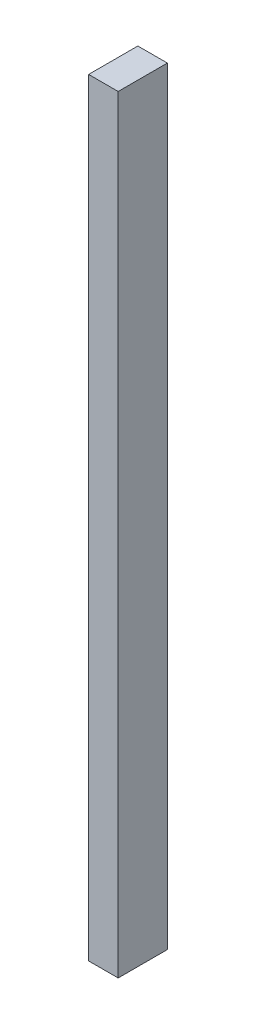
ISO-10303-21;
HEADER;
FILE_DESCRIPTION(('STEP AP214'),'2;1');
FILE_NAME('part.step','',(''),(''),'','','');
FILE_SCHEMA(('AUTOMOTIVE_DESIGN { 1 0 10303 214 1 1 1 1 }'));
ENDSEC;
DATA;
#1=APPLICATION_CONTEXT('core data for automotive mechanical design processes');
#2=APPLICATION_PROTOCOL_DEFINITION('international standard','automotive_design',2000,#1);
#3=PRODUCT_CONTEXT('',#1,'mechanical');
#4=PRODUCT('Part','Part','',(#3));
#5=PRODUCT_RELATED_PRODUCT_CATEGORY('part','',(#4));
#6=PRODUCT_DEFINITION_FORMATION('','',#4);
#7=PRODUCT_DEFINITION_CONTEXT('part definition',#1,'design');
#8=PRODUCT_DEFINITION('design','',#6,#7);
#9=PRODUCT_DEFINITION_SHAPE('','',#8);
#10=(LENGTH_UNIT() NAMED_UNIT(*) SI_UNIT(.MILLI.,.METRE.));
#11=(NAMED_UNIT(*) PLANE_ANGLE_UNIT() SI_UNIT($,.RADIAN.));
#12=(NAMED_UNIT(*) SI_UNIT($,.STERADIAN.) SOLID_ANGLE_UNIT());
#13=UNCERTAINTY_MEASURE_WITH_UNIT(LENGTH_MEASURE(1.E-05),#10,'distance_accuracy_value','');
#14=(GEOMETRIC_REPRESENTATION_CONTEXT(3) GLOBAL_UNCERTAINTY_ASSIGNED_CONTEXT((#13)) GLOBAL_UNIT_ASSIGNED_CONTEXT((#10,
#11,#12)) REPRESENTATION_CONTEXT('',''));
#15=CARTESIAN_POINT('',(0.,0.,0.));
#16=DIRECTION('',(0.,0.,1.));
#17=DIRECTION('',(1.,0.,0.));
#18=AXIS2_PLACEMENT_3D('',#15,#16,#17);
#19=CARTESIAN_POINT('',(19.05,990.6,31.75));
#20=DIRECTION('',(-1.,0.,0.));
#21=DIRECTION('',(0.,0.,1.));
#22=AXIS2_PLACEMENT_3D('',#19,#20,#21);
#23=PLANE('',#22);
#24=DIRECTION('',(0.,0.,-1.));
#25=VECTOR('',#24,1.);
#26=CARTESIAN_POINT('',(19.05,0.,31.75));
#27=LINE('',#26,#25);
#28=CARTESIAN_POINT('',(19.05,0.,31.75));
#29=VERTEX_POINT('',#28);
#30=CARTESIAN_POINT('',(19.05,0.,-31.75));
#31=VERTEX_POINT('',#30);
#32=EDGE_CURVE('E96',#29,#31,#27,.T.);
#33=ORIENTED_EDGE('',*,*,#32,.T.);
#34=DIRECTION('',(0.,-1.,0.));
#35=VECTOR('',#34,1.);
#36=CARTESIAN_POINT('',(19.05,990.6,-31.75));
#37=LINE('',#36,#35);
#38=CARTESIAN_POINT('',(19.05,990.6,-31.75));
#39=VERTEX_POINT('',#38);
#40=EDGE_CURVE('E11',#39,#31,#37,.T.);
#41=ORIENTED_EDGE('',*,*,#40,.F.);
#42=DIRECTION('',(0.,0.,-1.));
#43=VECTOR('',#42,1.);
#44=CARTESIAN_POINT('',(19.05,990.6,31.75));
#45=LINE('',#44,#43);
#46=CARTESIAN_POINT('',(19.05,990.6,31.75));
#47=VERTEX_POINT('',#46);
#48=EDGE_CURVE('E84',#47,#39,#45,.T.);
#49=ORIENTED_EDGE('',*,*,#48,.F.);
#50=DIRECTION('',(0.,-1.,0.));
#51=VECTOR('',#50,1.);
#52=CARTESIAN_POINT('',(19.05,990.6,31.75));
#53=LINE('',#52,#51);
#54=EDGE_CURVE('E92',#47,#29,#53,.T.);
#55=ORIENTED_EDGE('',*,*,#54,.T.);
#56=EDGE_LOOP('',(#33,#41,#49,#55));
#57=FACE_BOUND('',#56,.T.);
#58=ADVANCED_FACE('F33',(#57),#23,.F.);
#59=CARTESIAN_POINT('',(-19.05,990.6,-31.75));
#60=DIRECTION('',(0.,0.,1.));
#61=DIRECTION('',(1.,0.,0.));
#62=AXIS2_PLACEMENT_3D('',#59,#60,#61);
#63=PLANE('',#62);
#64=DIRECTION('',(-1.,0.,0.));
#65=VECTOR('',#64,1.);
#66=CARTESIAN_POINT('',(-19.05,0.,-31.75));
#67=LINE('',#66,#65);
#68=CARTESIAN_POINT('',(-19.05,0.,-31.75));
#69=VERTEX_POINT('',#68);
#70=EDGE_CURVE('E88',#31,#69,#67,.T.);
#71=ORIENTED_EDGE('',*,*,#70,.T.);
#72=DIRECTION('',(0.,-1.,0.));
#73=VECTOR('',#72,1.);
#74=CARTESIAN_POINT('',(-19.05,990.6,-31.75));
#75=LINE('',#74,#73);
#76=CARTESIAN_POINT('',(-19.05,990.6,-31.75));
#77=VERTEX_POINT('',#76);
#78=EDGE_CURVE('E41',#77,#69,#75,.T.);
#79=ORIENTED_EDGE('',*,*,#78,.F.);
#80=DIRECTION('',(-1.,0.,0.));
#81=VECTOR('',#80,1.);
#82=CARTESIAN_POINT('',(-19.05,990.6,-31.75));
#83=LINE('',#82,#81);
#84=EDGE_CURVE('E79',#39,#77,#83,.T.);
#85=ORIENTED_EDGE('',*,*,#84,.F.);
#86=ORIENTED_EDGE('',*,*,#40,.T.);
#87=EDGE_LOOP('',(#71,#79,#85,#86));
#88=FACE_BOUND('',#87,.T.);
#89=ADVANCED_FACE('F87',(#88),#63,.F.);
#90=CARTESIAN_POINT('',(-19.05,990.6,31.75));
#91=DIRECTION('',(1.,0.,0.));
#92=DIRECTION('',(0.,0.,-1.));
#93=AXIS2_PLACEMENT_3D('',#90,#91,#92);
#94=PLANE('',#93);
#95=DIRECTION('',(0.,0.,1.));
#96=VECTOR('',#95,1.);
#97=CARTESIAN_POINT('',(-19.05,0.,31.75));
#98=LINE('',#97,#96);
#99=CARTESIAN_POINT('',(-19.05,0.,31.75));
#100=VERTEX_POINT('',#99);
#101=EDGE_CURVE('E66',#69,#100,#98,.T.);
#102=ORIENTED_EDGE('',*,*,#101,.T.);
#103=DIRECTION('',(0.,-1.,0.));
#104=VECTOR('',#103,1.);
#105=CARTESIAN_POINT('',(-19.05,990.6,31.75));
#106=LINE('',#105,#104);
#107=CARTESIAN_POINT('',(-19.05,990.6,31.75));
#108=VERTEX_POINT('',#107);
#109=EDGE_CURVE('E89',#108,#100,#106,.T.);
#110=ORIENTED_EDGE('',*,*,#109,.F.);
#111=DIRECTION('',(0.,0.,1.));
#112=VECTOR('',#111,1.);
#113=CARTESIAN_POINT('',(-19.05,990.6,31.75));
#114=LINE('',#113,#112);
#115=EDGE_CURVE('E82',#77,#108,#114,.T.);
#116=ORIENTED_EDGE('',*,*,#115,.F.);
#117=ORIENTED_EDGE('',*,*,#78,.T.);
#118=EDGE_LOOP('',(#102,#110,#116,#117));
#119=FACE_BOUND('',#118,.T.);
#120=ADVANCED_FACE('F90',(#119),#94,.F.);
#121=CARTESIAN_POINT('',(-19.05,990.6,31.75));
#122=DIRECTION('',(0.,0.,-1.));
#123=DIRECTION('',(-1.,0.,0.));
#124=AXIS2_PLACEMENT_3D('',#121,#122,#123);
#125=PLANE('',#124);
#126=DIRECTION('',(1.,0.,0.));
#127=VECTOR('',#126,1.);
#128=CARTESIAN_POINT('',(-19.05,0.,31.75));
#129=LINE('',#128,#127);
#130=EDGE_CURVE('E72',#100,#29,#129,.T.);
#131=ORIENTED_EDGE('',*,*,#130,.T.);
#132=ORIENTED_EDGE('',*,*,#54,.F.);
#133=DIRECTION('',(1.,0.,0.));
#134=VECTOR('',#133,1.);
#135=CARTESIAN_POINT('',(-19.05,990.6,31.75));
#136=LINE('',#135,#134);
#137=EDGE_CURVE('E49',#108,#47,#136,.T.);
#138=ORIENTED_EDGE('',*,*,#137,.F.);
#139=ORIENTED_EDGE('',*,*,#109,.T.);
#140=EDGE_LOOP('',(#131,#132,#138,#139));
#141=FACE_BOUND('',#140,.T.);
#142=ADVANCED_FACE('F103',(#141),#125,.F.);
#143=CARTESIAN_POINT('',(0.,990.6,0.));
#144=DIRECTION('',(0.,-1.,0.));
#145=DIRECTION('',(0.,0.,-1.));
#146=AXIS2_PLACEMENT_3D('',#143,#144,#145);
#147=PLANE('',#146);
#148=ORIENTED_EDGE('',*,*,#48,.T.);
#149=ORIENTED_EDGE('',*,*,#84,.T.);
#150=ORIENTED_EDGE('',*,*,#115,.T.);
#151=ORIENTED_EDGE('',*,*,#137,.T.);
#152=EDGE_LOOP('',(#148,#149,#150,#151));
#153=FACE_BOUND('',#152,.T.);
#154=ADVANCED_FACE('F80',(#153),#147,.F.);
#155=CARTESIAN_POINT('',(0.,0.,0.));
#156=DIRECTION('',(0.,-1.,0.));
#157=DIRECTION('',(0.,0.,-1.));
#158=AXIS2_PLACEMENT_3D('',#155,#156,#157);
#159=PLANE('',#158);
#160=ORIENTED_EDGE('',*,*,#32,.F.);
#161=ORIENTED_EDGE('',*,*,#130,.F.);
#162=ORIENTED_EDGE('',*,*,#101,.F.);
#163=ORIENTED_EDGE('',*,*,#70,.F.);
#164=EDGE_LOOP('',(#160,#161,#162,#163));
#165=FACE_BOUND('',#164,.T.);
#166=ADVANCED_FACE('F106',(#165),#159,.T.);
#167=CLOSED_SHELL('',(#58,#89,#120,#142,#154,#166));
#168=MANIFOLD_SOLID_BREP('B2',#167);
#169=ADVANCED_BREP_SHAPE_REPRESENTATION('',(#18,#168),#14);
#170=SHAPE_DEFINITION_REPRESENTATION(#9,#169);
ENDSEC;
END-ISO-10303-21;
